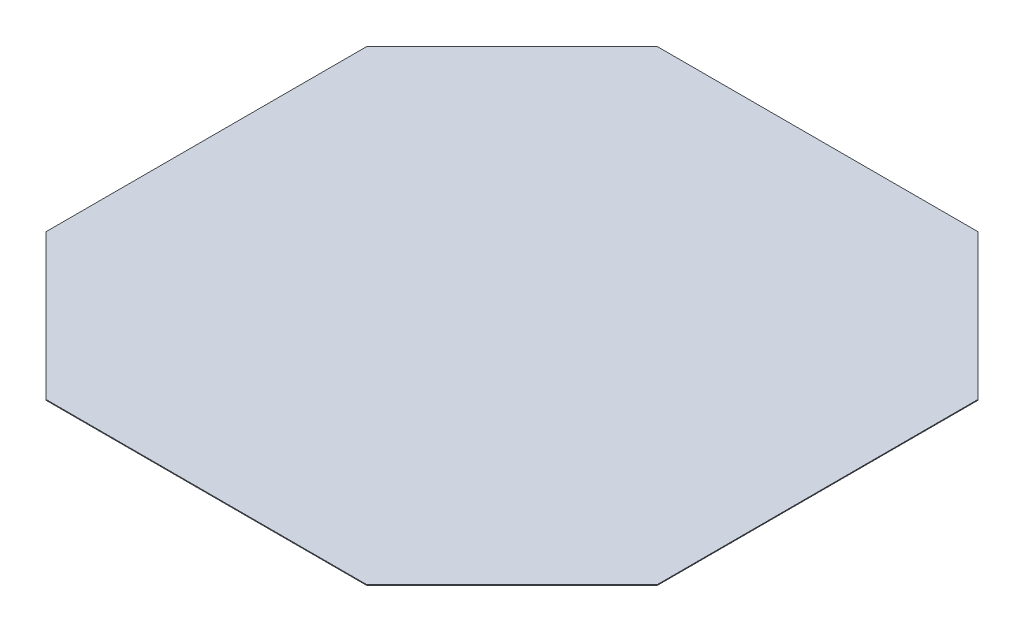
ISO-10303-21;
HEADER;
FILE_DESCRIPTION(('STEP AP214'),'2;1');
FILE_NAME('part.step','',(''),(''),'','','');
FILE_SCHEMA(('AUTOMOTIVE_DESIGN { 1 0 10303 214 1 1 1 1 }'));
ENDSEC;
DATA;
#1=APPLICATION_CONTEXT('core data for automotive mechanical design processes');
#2=APPLICATION_PROTOCOL_DEFINITION('international standard','automotive_design',2000,#1);
#3=PRODUCT_CONTEXT('',#1,'mechanical');
#4=PRODUCT('Part','Part','',(#3));
#5=PRODUCT_RELATED_PRODUCT_CATEGORY('part','',(#4));
#6=PRODUCT_DEFINITION_FORMATION('','',#4);
#7=PRODUCT_DEFINITION_CONTEXT('part definition',#1,'design');
#8=PRODUCT_DEFINITION('design','',#6,#7);
#9=PRODUCT_DEFINITION_SHAPE('','',#8);
#10=(LENGTH_UNIT() NAMED_UNIT(*) SI_UNIT(.MILLI.,.METRE.));
#11=(NAMED_UNIT(*) PLANE_ANGLE_UNIT() SI_UNIT($,.RADIAN.));
#12=(NAMED_UNIT(*) SI_UNIT($,.STERADIAN.) SOLID_ANGLE_UNIT());
#13=UNCERTAINTY_MEASURE_WITH_UNIT(LENGTH_MEASURE(1.E-05),#10,'distance_accuracy_value','');
#14=(GEOMETRIC_REPRESENTATION_CONTEXT(3) GLOBAL_UNCERTAINTY_ASSIGNED_CONTEXT((#13)) GLOBAL_UNIT_ASSIGNED_CONTEXT((#10,
#11,#12)) REPRESENTATION_CONTEXT('',''));
#15=CARTESIAN_POINT('',(0.,0.,0.));
#16=DIRECTION('',(0.,0.,1.));
#17=DIRECTION('',(1.,0.,0.));
#18=AXIS2_PLACEMENT_3D('',#15,#16,#17);
#19=CARTESIAN_POINT('',(-673.1,3.175,-1282.7));
#20=DIRECTION('',(0.,0.,1.));
#21=DIRECTION('',(1.,0.,0.));
#22=AXIS2_PLACEMENT_3D('',#19,#20,#21);
#23=PLANE('',#22);
#24=DIRECTION('',(-1.,0.,0.));
#25=VECTOR('',#24,1.);
#26=CARTESIAN_POINT('',(-673.1,0.,-1282.7));
#27=LINE('',#26,#25);
#28=CARTESIAN_POINT('',(673.1,0.,-1282.7));
#29=VERTEX_POINT('',#28);
#30=CARTESIAN_POINT('',(-673.1,0.,-1282.7));
#31=VERTEX_POINT('',#30);
#32=EDGE_CURVE('E126',#29,#31,#27,.T.);
#33=ORIENTED_EDGE('',*,*,#32,.T.);
#34=DIRECTION('',(0.,-1.,0.));
#35=VECTOR('',#34,1.);
#36=CARTESIAN_POINT('',(-673.1,3.175,-1282.7));
#37=LINE('',#36,#35);
#38=CARTESIAN_POINT('',(-673.1,3.175,-1282.7));
#39=VERTEX_POINT('',#38);
#40=EDGE_CURVE('E11',#39,#31,#37,.T.);
#41=ORIENTED_EDGE('',*,*,#40,.F.);
#42=DIRECTION('',(-1.,0.,0.));
#43=VECTOR('',#42,1.);
#44=CARTESIAN_POINT('',(-673.1,3.175,-1282.7));
#45=LINE('',#44,#43);
#46=CARTESIAN_POINT('',(673.1,3.175,-1282.7));
#47=VERTEX_POINT('',#46);
#48=EDGE_CURVE('E140',#47,#39,#45,.T.);
#49=ORIENTED_EDGE('',*,*,#48,.F.);
#50=DIRECTION('',(0.,-1.,0.));
#51=VECTOR('',#50,1.);
#52=CARTESIAN_POINT('',(673.1,3.175,-1282.7));
#53=LINE('',#52,#51);
#54=EDGE_CURVE('E122',#47,#29,#53,.T.);
#55=ORIENTED_EDGE('',*,*,#54,.T.);
#56=EDGE_LOOP('',(#33,#41,#49,#55));
#57=FACE_BOUND('',#56,.T.);
#58=ADVANCED_FACE('F30',(#57),#23,.F.);
#59=CARTESIAN_POINT('',(-673.1,3.175,-1282.7));
#60=DIRECTION('',(0.707106781186548,0.,0.707106781186548));
#61=DIRECTION('',(0.707106781186548,0.,-0.707106781186548));
#62=AXIS2_PLACEMENT_3D('',#59,#60,#61);
#63=PLANE('',#62);
#64=DIRECTION('',(-0.707106781186547,0.,0.707106781186547));
#65=VECTOR('',#64,1.);
#66=CARTESIAN_POINT('',(-673.1,0.,-1282.7));
#67=LINE('',#66,#65);
#68=CARTESIAN_POINT('',(-1282.7,0.,-673.1));
#69=VERTEX_POINT('',#68);
#70=EDGE_CURVE('E129',#31,#69,#67,.T.);
#71=ORIENTED_EDGE('',*,*,#70,.T.);
#72=DIRECTION('',(0.,-1.,0.));
#73=VECTOR('',#72,1.);
#74=CARTESIAN_POINT('',(-1282.7,3.175,-673.1));
#75=LINE('',#74,#73);
#76=CARTESIAN_POINT('',(-1282.7,3.175,-673.1));
#77=VERTEX_POINT('',#76);
#78=EDGE_CURVE('E38',#77,#69,#75,.T.);
#79=ORIENTED_EDGE('',*,*,#78,.F.);
#80=DIRECTION('',(-0.707106781186547,0.,0.707106781186547));
#81=VECTOR('',#80,1.);
#82=CARTESIAN_POINT('',(-673.1,3.175,-1282.7));
#83=LINE('',#82,#81);
#84=EDGE_CURVE('E89',#39,#77,#83,.T.);
#85=ORIENTED_EDGE('',*,*,#84,.F.);
#86=ORIENTED_EDGE('',*,*,#40,.T.);
#87=EDGE_LOOP('',(#71,#79,#85,#86));
#88=FACE_BOUND('',#87,.T.);
#89=ADVANCED_FACE('F175',(#88),#63,.F.);
#90=CARTESIAN_POINT('',(-1282.7,3.175,-673.1));
#91=DIRECTION('',(1.,0.,0.));
#92=DIRECTION('',(0.,0.,-1.));
#93=AXIS2_PLACEMENT_3D('',#90,#91,#92);
#94=PLANE('',#93);
#95=DIRECTION('',(0.,0.,1.));
#96=VECTOR('',#95,1.);
#97=CARTESIAN_POINT('',(-1282.7,0.,-673.1));
#98=LINE('',#97,#96);
#99=CARTESIAN_POINT('',(-1282.7,0.,673.1));
#100=VERTEX_POINT('',#99);
#101=EDGE_CURVE('E131',#69,#100,#98,.T.);
#102=ORIENTED_EDGE('',*,*,#101,.T.);
#103=DIRECTION('',(0.,-1.,0.));
#104=VECTOR('',#103,1.);
#105=CARTESIAN_POINT('',(-1282.7,3.175,673.1));
#106=LINE('',#105,#104);
#107=CARTESIAN_POINT('',(-1282.7,3.175,673.1));
#108=VERTEX_POINT('',#107);
#109=EDGE_CURVE('E147',#108,#100,#106,.T.);
#110=ORIENTED_EDGE('',*,*,#109,.F.);
#111=DIRECTION('',(0.,0.,1.));
#112=VECTOR('',#111,1.);
#113=CARTESIAN_POINT('',(-1282.7,3.175,-673.1));
#114=LINE('',#113,#112);
#115=EDGE_CURVE('E155',#77,#108,#114,.T.);
#116=ORIENTED_EDGE('',*,*,#115,.F.);
#117=ORIENTED_EDGE('',*,*,#78,.T.);
#118=EDGE_LOOP('',(#102,#110,#116,#117));
#119=FACE_BOUND('',#118,.T.);
#120=ADVANCED_FACE('F153',(#119),#94,.F.);
#121=CARTESIAN_POINT('',(-673.1,3.175,1282.7));
#122=DIRECTION('',(0.707106781186548,0.,-0.707106781186548));
#123=DIRECTION('',(-0.707106781186548,0.,-0.707106781186548));
#124=AXIS2_PLACEMENT_3D('',#121,#122,#123);
#125=PLANE('',#124);
#126=DIRECTION('',(0.707106781186547,0.,0.707106781186547));
#127=VECTOR('',#126,1.);
#128=CARTESIAN_POINT('',(-673.1,0.,1282.7));
#129=LINE('',#128,#127);
#130=CARTESIAN_POINT('',(-673.1,0.,1282.7));
#131=VERTEX_POINT('',#130);
#132=EDGE_CURVE('E133',#100,#131,#129,.T.);
#133=ORIENTED_EDGE('',*,*,#132,.T.);
#134=DIRECTION('',(0.,-1.,0.));
#135=VECTOR('',#134,1.);
#136=CARTESIAN_POINT('',(-673.1,3.175,1282.7));
#137=LINE('',#136,#135);
#138=CARTESIAN_POINT('',(-673.1,3.175,1282.7));
#139=VERTEX_POINT('',#138);
#140=EDGE_CURVE('E144',#139,#131,#137,.T.);
#141=ORIENTED_EDGE('',*,*,#140,.F.);
#142=DIRECTION('',(0.707106781186547,0.,0.707106781186547));
#143=VECTOR('',#142,1.);
#144=CARTESIAN_POINT('',(-673.1,3.175,1282.7));
#145=LINE('',#144,#143);
#146=EDGE_CURVE('E167',#108,#139,#145,.T.);
#147=ORIENTED_EDGE('',*,*,#146,.F.);
#148=ORIENTED_EDGE('',*,*,#109,.T.);
#149=EDGE_LOOP('',(#133,#141,#147,#148));
#150=FACE_BOUND('',#149,.T.);
#151=ADVANCED_FACE('F163',(#150),#125,.F.);
#152=CARTESIAN_POINT('',(-673.1,3.175,1282.7));
#153=DIRECTION('',(0.,0.,-1.));
#154=DIRECTION('',(-1.,0.,0.));
#155=AXIS2_PLACEMENT_3D('',#152,#153,#154);
#156=PLANE('',#155);
#157=DIRECTION('',(1.,0.,0.));
#158=VECTOR('',#157,1.);
#159=CARTESIAN_POINT('',(-673.1,0.,1282.7));
#160=LINE('',#159,#158);
#161=CARTESIAN_POINT('',(673.1,0.,1282.7));
#162=VERTEX_POINT('',#161);
#163=EDGE_CURVE('E135',#131,#162,#160,.T.);
#164=ORIENTED_EDGE('',*,*,#163,.T.);
#165=DIRECTION('',(0.,-1.,0.));
#166=VECTOR('',#165,1.);
#167=CARTESIAN_POINT('',(673.1,3.175,1282.7));
#168=LINE('',#167,#166);
#169=CARTESIAN_POINT('',(673.1,3.175,1282.7));
#170=VERTEX_POINT('',#169);
#171=EDGE_CURVE('E117',#170,#162,#168,.T.);
#172=ORIENTED_EDGE('',*,*,#171,.F.);
#173=DIRECTION('',(1.,0.,0.));
#174=VECTOR('',#173,1.);
#175=CARTESIAN_POINT('',(-673.1,3.175,1282.7));
#176=LINE('',#175,#174);
#177=EDGE_CURVE('E108',#139,#170,#176,.T.);
#178=ORIENTED_EDGE('',*,*,#177,.F.);
#179=ORIENTED_EDGE('',*,*,#140,.T.);
#180=EDGE_LOOP('',(#164,#172,#178,#179));
#181=FACE_BOUND('',#180,.T.);
#182=ADVANCED_FACE('F166',(#181),#156,.F.);
#183=CARTESIAN_POINT('',(673.1,3.175,1282.7));
#184=DIRECTION('',(-0.707106781186548,0.,-0.707106781186548));
#185=DIRECTION('',(-0.707106781186548,0.,0.707106781186548));
#186=AXIS2_PLACEMENT_3D('',#183,#184,#185);
#187=PLANE('',#186);
#188=DIRECTION('',(0.707106781186547,0.,-0.707106781186547));
#189=VECTOR('',#188,1.);
#190=CARTESIAN_POINT('',(673.1,0.,1282.7));
#191=LINE('',#190,#189);
#192=CARTESIAN_POINT('',(1282.7,0.,673.1));
#193=VERTEX_POINT('',#192);
#194=EDGE_CURVE('E116',#162,#193,#191,.T.);
#195=ORIENTED_EDGE('',*,*,#194,.T.);
#196=DIRECTION('',(0.,-1.,0.));
#197=VECTOR('',#196,1.);
#198=CARTESIAN_POINT('',(1282.7,3.175,673.1));
#199=LINE('',#198,#197);
#200=CARTESIAN_POINT('',(1282.7,3.175,673.1));
#201=VERTEX_POINT('',#200);
#202=EDGE_CURVE('E113',#201,#193,#199,.T.);
#203=ORIENTED_EDGE('',*,*,#202,.F.);
#204=DIRECTION('',(0.707106781186547,0.,-0.707106781186547));
#205=VECTOR('',#204,1.);
#206=CARTESIAN_POINT('',(673.1,3.175,1282.7));
#207=LINE('',#206,#205);
#208=EDGE_CURVE('E102',#170,#201,#207,.T.);
#209=ORIENTED_EDGE('',*,*,#208,.F.);
#210=ORIENTED_EDGE('',*,*,#171,.T.);
#211=EDGE_LOOP('',(#195,#203,#209,#210));
#212=FACE_BOUND('',#211,.T.);
#213=ADVANCED_FACE('F114',(#212),#187,.F.);
#214=CARTESIAN_POINT('',(1282.7,3.175,-673.1));
#215=DIRECTION('',(-1.,0.,0.));
#216=DIRECTION('',(0.,0.,1.));
#217=AXIS2_PLACEMENT_3D('',#214,#215,#216);
#218=PLANE('',#217);
#219=DIRECTION('',(0.,0.,-1.));
#220=VECTOR('',#219,1.);
#221=CARTESIAN_POINT('',(1282.7,0.,-673.1));
#222=LINE('',#221,#220);
#223=CARTESIAN_POINT('',(1282.7,0.,-673.1));
#224=VERTEX_POINT('',#223);
#225=EDGE_CURVE('E75',#193,#224,#222,.T.);
#226=ORIENTED_EDGE('',*,*,#225,.T.);
#227=DIRECTION('',(0.,-1.,0.));
#228=VECTOR('',#227,1.);
#229=CARTESIAN_POINT('',(1282.7,3.175,-673.1));
#230=LINE('',#229,#228);
#231=CARTESIAN_POINT('',(1282.7,3.175,-673.1));
#232=VERTEX_POINT('',#231);
#233=EDGE_CURVE('E118',#232,#224,#230,.T.);
#234=ORIENTED_EDGE('',*,*,#233,.F.);
#235=DIRECTION('',(0.,0.,-1.));
#236=VECTOR('',#235,1.);
#237=CARTESIAN_POINT('',(1282.7,3.175,-673.1));
#238=LINE('',#237,#236);
#239=EDGE_CURVE('E106',#201,#232,#238,.T.);
#240=ORIENTED_EDGE('',*,*,#239,.F.);
#241=ORIENTED_EDGE('',*,*,#202,.T.);
#242=EDGE_LOOP('',(#226,#234,#240,#241));
#243=FACE_BOUND('',#242,.T.);
#244=ADVANCED_FACE('F120',(#243),#218,.F.);
#245=CARTESIAN_POINT('',(673.1,3.175,-1282.7));
#246=DIRECTION('',(-0.707106781186548,0.,0.707106781186548));
#247=DIRECTION('',(0.707106781186548,0.,0.707106781186548));
#248=AXIS2_PLACEMENT_3D('',#245,#246,#247);
#249=PLANE('',#248);
#250=DIRECTION('',(-0.707106781186547,0.,-0.707106781186547));
#251=VECTOR('',#250,1.);
#252=CARTESIAN_POINT('',(673.1,0.,-1282.7));
#253=LINE('',#252,#251);
#254=EDGE_CURVE('E81',#224,#29,#253,.T.);
#255=ORIENTED_EDGE('',*,*,#254,.T.);
#256=ORIENTED_EDGE('',*,*,#54,.F.);
#257=DIRECTION('',(-0.707106781186547,0.,-0.707106781186547));
#258=VECTOR('',#257,1.);
#259=CARTESIAN_POINT('',(673.1,3.175,-1282.7));
#260=LINE('',#259,#258);
#261=EDGE_CURVE('E46',#232,#47,#260,.T.);
#262=ORIENTED_EDGE('',*,*,#261,.F.);
#263=ORIENTED_EDGE('',*,*,#233,.T.);
#264=EDGE_LOOP('',(#255,#256,#262,#263));
#265=FACE_BOUND('',#264,.T.);
#266=ADVANCED_FACE('F191',(#265),#249,.F.);
#267=CARTESIAN_POINT('',(1282.7,3.175,-1282.7));
#268=DIRECTION('',(0.,-1.,0.));
#269=DIRECTION('',(0.,0.,-1.));
#270=AXIS2_PLACEMENT_3D('',#267,#268,#269);
#271=PLANE('',#270);
#272=ORIENTED_EDGE('',*,*,#48,.T.);
#273=ORIENTED_EDGE('',*,*,#84,.T.);
#274=ORIENTED_EDGE('',*,*,#115,.T.);
#275=ORIENTED_EDGE('',*,*,#146,.T.);
#276=ORIENTED_EDGE('',*,*,#177,.T.);
#277=ORIENTED_EDGE('',*,*,#208,.T.);
#278=ORIENTED_EDGE('',*,*,#239,.T.);
#279=ORIENTED_EDGE('',*,*,#261,.T.);
#280=EDGE_LOOP('',(#272,#273,#274,#275,#276,#277,#278,#279));
#281=FACE_BOUND('',#280,.T.);
#282=ADVANCED_FACE('F104',(#281),#271,.F.);
#283=CARTESIAN_POINT('',(1282.7,0.,-1282.7));
#284=DIRECTION('',(0.,-1.,0.));
#285=DIRECTION('',(0.,0.,-1.));
#286=AXIS2_PLACEMENT_3D('',#283,#284,#285);
#287=PLANE('',#286);
#288=ORIENTED_EDGE('',*,*,#32,.F.);
#289=ORIENTED_EDGE('',*,*,#254,.F.);
#290=ORIENTED_EDGE('',*,*,#225,.F.);
#291=ORIENTED_EDGE('',*,*,#194,.F.);
#292=ORIENTED_EDGE('',*,*,#163,.F.);
#293=ORIENTED_EDGE('',*,*,#132,.F.);
#294=ORIENTED_EDGE('',*,*,#101,.F.);
#295=ORIENTED_EDGE('',*,*,#70,.F.);
#296=EDGE_LOOP('',(#288,#289,#290,#291,#292,#293,#294,#295));
#297=FACE_BOUND('',#296,.T.);
#298=ADVANCED_FACE('F159',(#297),#287,.T.);
#299=CLOSED_SHELL('',(#58,#89,#120,#151,#182,#213,#244,#266,#282,#298));
#300=MANIFOLD_SOLID_BREP('B2',#299);
#301=ADVANCED_BREP_SHAPE_REPRESENTATION('',(#18,#300),#14);
#302=SHAPE_DEFINITION_REPRESENTATION(#9,#301);
ENDSEC;
END-ISO-10303-21;
